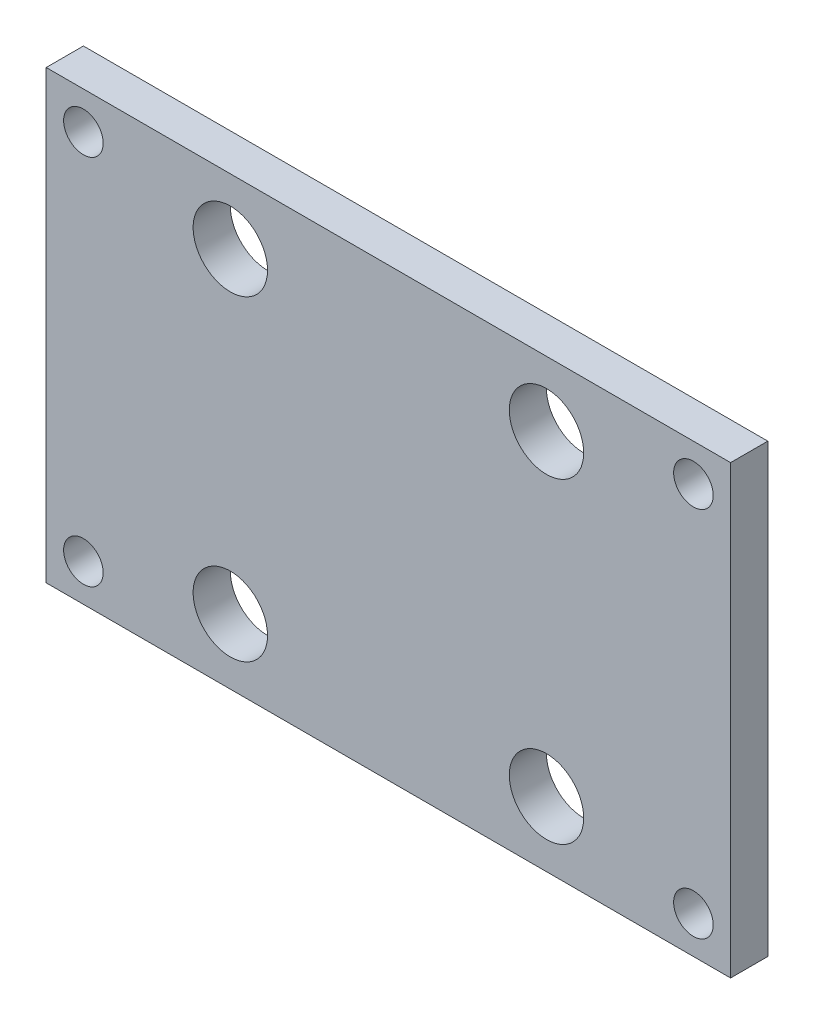
ISO-10303-21;
HEADER;
FILE_DESCRIPTION(('STEP AP214'),'2;1');
FILE_NAME('part.step','',(''),(''),'','','');
FILE_SCHEMA(('AUTOMOTIVE_DESIGN { 1 0 10303 214 1 1 1 1 }'));
ENDSEC;
DATA;
#1=APPLICATION_CONTEXT('core data for automotive mechanical design processes');
#2=APPLICATION_PROTOCOL_DEFINITION('international standard','automotive_design',2000,#1);
#3=PRODUCT_CONTEXT('',#1,'mechanical');
#4=PRODUCT('Part','Part','',(#3));
#5=PRODUCT_RELATED_PRODUCT_CATEGORY('part','',(#4));
#6=PRODUCT_DEFINITION_FORMATION('','',#4);
#7=PRODUCT_DEFINITION_CONTEXT('part definition',#1,'design');
#8=PRODUCT_DEFINITION('design','',#6,#7);
#9=PRODUCT_DEFINITION_SHAPE('','',#8);
#10=(LENGTH_UNIT() NAMED_UNIT(*) SI_UNIT(.MILLI.,.METRE.));
#11=(NAMED_UNIT(*) PLANE_ANGLE_UNIT() SI_UNIT($,.RADIAN.));
#12=(NAMED_UNIT(*) SI_UNIT($,.STERADIAN.) SOLID_ANGLE_UNIT());
#13=UNCERTAINTY_MEASURE_WITH_UNIT(LENGTH_MEASURE(1.E-05),#10,'distance_accuracy_value','');
#14=(GEOMETRIC_REPRESENTATION_CONTEXT(3) GLOBAL_UNCERTAINTY_ASSIGNED_CONTEXT((#13)) GLOBAL_UNIT_ASSIGNED_CONTEXT((#10,
#11,#12)) REPRESENTATION_CONTEXT('',''));
#15=CARTESIAN_POINT('',(0.,0.,0.));
#16=DIRECTION('',(0.,0.,1.));
#17=DIRECTION('',(1.,0.,0.));
#18=AXIS2_PLACEMENT_3D('',#15,#16,#17);
#19=CARTESIAN_POINT('',(58.42,-38.1,6.35));
#20=DIRECTION('',(-1.,0.,0.));
#21=DIRECTION('',(0.,0.,1.));
#22=AXIS2_PLACEMENT_3D('',#19,#20,#21);
#23=PLANE('',#22);
#24=DIRECTION('',(0.,1.,0.));
#25=VECTOR('',#24,1.);
#26=CARTESIAN_POINT('',(58.42,-38.1,0.));
#27=LINE('',#26,#25);
#28=CARTESIAN_POINT('',(58.42,-38.1,0.));
#29=VERTEX_POINT('',#28);
#30=CARTESIAN_POINT('',(58.42,38.1,0.));
#31=VERTEX_POINT('',#30);
#32=EDGE_CURVE('E100',#29,#31,#27,.T.);
#33=ORIENTED_EDGE('',*,*,#32,.T.);
#34=DIRECTION('',(0.,0.,-1.));
#35=VECTOR('',#34,1.);
#36=CARTESIAN_POINT('',(58.42,38.1,6.35));
#37=LINE('',#36,#35);
#38=CARTESIAN_POINT('',(58.42,38.1,6.35));
#39=VERTEX_POINT('',#38);
#40=EDGE_CURVE('E11',#39,#31,#37,.T.);
#41=ORIENTED_EDGE('',*,*,#40,.F.);
#42=DIRECTION('',(0.,1.,0.));
#43=VECTOR('',#42,1.);
#44=CARTESIAN_POINT('',(58.42,-38.1,6.35));
#45=LINE('',#44,#43);
#46=CARTESIAN_POINT('',(58.42,-38.1,6.35));
#47=VERTEX_POINT('',#46);
#48=EDGE_CURVE('E87',#47,#39,#45,.T.);
#49=ORIENTED_EDGE('',*,*,#48,.F.);
#50=DIRECTION('',(0.,0.,-1.));
#51=VECTOR('',#50,1.);
#52=CARTESIAN_POINT('',(58.42,-38.1,6.35));
#53=LINE('',#52,#51);
#54=EDGE_CURVE('E96',#47,#29,#53,.T.);
#55=ORIENTED_EDGE('',*,*,#54,.T.);
#56=EDGE_LOOP('',(#33,#41,#49,#55));
#57=FACE_BOUND('',#56,.T.);
#58=ADVANCED_FACE('F34',(#57),#23,.F.);
#59=CARTESIAN_POINT('',(-58.42,38.1,6.35));
#60=DIRECTION('',(0.,-1.,0.));
#61=DIRECTION('',(0.,0.,-1.));
#62=AXIS2_PLACEMENT_3D('',#59,#60,#61);
#63=PLANE('',#62);
#64=DIRECTION('',(-1.,0.,0.));
#65=VECTOR('',#64,1.);
#66=CARTESIAN_POINT('',(-58.42,38.1,0.));
#67=LINE('',#66,#65);
#68=CARTESIAN_POINT('',(-58.42,38.1,0.));
#69=VERTEX_POINT('',#68);
#70=EDGE_CURVE('E91',#31,#69,#67,.T.);
#71=ORIENTED_EDGE('',*,*,#70,.T.);
#72=DIRECTION('',(0.,0.,-1.));
#73=VECTOR('',#72,1.);
#74=CARTESIAN_POINT('',(-58.42,38.1,6.35));
#75=LINE('',#74,#73);
#76=CARTESIAN_POINT('',(-58.42,38.1,6.35));
#77=VERTEX_POINT('',#76);
#78=EDGE_CURVE('E43',#77,#69,#75,.T.);
#79=ORIENTED_EDGE('',*,*,#78,.F.);
#80=DIRECTION('',(-1.,0.,0.));
#81=VECTOR('',#80,1.);
#82=CARTESIAN_POINT('',(-58.42,38.1,6.35));
#83=LINE('',#82,#81);
#84=EDGE_CURVE('E82',#39,#77,#83,.T.);
#85=ORIENTED_EDGE('',*,*,#84,.F.);
#86=ORIENTED_EDGE('',*,*,#40,.T.);
#87=EDGE_LOOP('',(#71,#79,#85,#86));
#88=FACE_BOUND('',#87,.T.);
#89=ADVANCED_FACE('F90',(#88),#63,.F.);
#90=CARTESIAN_POINT('',(-58.42,-38.1,6.35));
#91=DIRECTION('',(1.,0.,0.));
#92=DIRECTION('',(0.,0.,-1.));
#93=AXIS2_PLACEMENT_3D('',#90,#91,#92);
#94=PLANE('',#93);
#95=DIRECTION('',(0.,-1.,0.));
#96=VECTOR('',#95,1.);
#97=CARTESIAN_POINT('',(-58.42,-38.1,0.));
#98=LINE('',#97,#96);
#99=CARTESIAN_POINT('',(-58.42,-38.1,0.));
#100=VERTEX_POINT('',#99);
#101=EDGE_CURVE('E69',#69,#100,#98,.T.);
#102=ORIENTED_EDGE('',*,*,#101,.T.);
#103=DIRECTION('',(0.,0.,-1.));
#104=VECTOR('',#103,1.);
#105=CARTESIAN_POINT('',(-58.42,-38.1,6.35));
#106=LINE('',#105,#104);
#107=CARTESIAN_POINT('',(-58.42,-38.1,6.35));
#108=VERTEX_POINT('',#107);
#109=EDGE_CURVE('E92',#108,#100,#106,.T.);
#110=ORIENTED_EDGE('',*,*,#109,.F.);
#111=DIRECTION('',(0.,-1.,0.));
#112=VECTOR('',#111,1.);
#113=CARTESIAN_POINT('',(-58.42,-38.1,6.35));
#114=LINE('',#113,#112);
#115=EDGE_CURVE('E85',#77,#108,#114,.T.);
#116=ORIENTED_EDGE('',*,*,#115,.F.);
#117=ORIENTED_EDGE('',*,*,#78,.T.);
#118=EDGE_LOOP('',(#102,#110,#116,#117));
#119=FACE_BOUND('',#118,.T.);
#120=ADVANCED_FACE('F94',(#119),#94,.F.);
#121=CARTESIAN_POINT('',(-58.42,-38.1,6.35));
#122=DIRECTION('',(0.,1.,0.));
#123=DIRECTION('',(0.,0.,1.));
#124=AXIS2_PLACEMENT_3D('',#121,#122,#123);
#125=PLANE('',#124);
#126=DIRECTION('',(1.,0.,0.));
#127=VECTOR('',#126,1.);
#128=CARTESIAN_POINT('',(-58.42,-38.1,0.));
#129=LINE('',#128,#127);
#130=EDGE_CURVE('E75',#100,#29,#129,.T.);
#131=ORIENTED_EDGE('',*,*,#130,.T.);
#132=ORIENTED_EDGE('',*,*,#54,.F.);
#133=DIRECTION('',(1.,0.,0.));
#134=VECTOR('',#133,1.);
#135=CARTESIAN_POINT('',(-58.42,-38.1,6.35));
#136=LINE('',#135,#134);
#137=EDGE_CURVE('E52',#108,#47,#136,.T.);
#138=ORIENTED_EDGE('',*,*,#137,.F.);
#139=ORIENTED_EDGE('',*,*,#109,.T.);
#140=EDGE_LOOP('',(#131,#132,#138,#139));
#141=FACE_BOUND('',#140,.T.);
#142=ADVANCED_FACE('F168',(#141),#125,.F.);
#143=CARTESIAN_POINT('',(58.42,38.1,6.35));
#144=DIRECTION('',(0.,0.,-1.));
#145=DIRECTION('',(-1.,0.,0.));
#146=AXIS2_PLACEMENT_3D('',#143,#144,#145);
#147=PLANE('',#146);
#148=CARTESIAN_POINT('',(-26.9875,26.9875,6.35));
#149=DIRECTION('',(0.,0.,1.));
#150=DIRECTION('',(1.,0.,0.));
#151=AXIS2_PLACEMENT_3D('',#148,#149,#150);
#152=CIRCLE('',#151,6.35);
#153=CARTESIAN_POINT('',(-20.6375,26.9875,6.35));
#154=VERTEX_POINT('',#153);
#155=EDGE_CURVE('E129',#154,#154,#152,.T.);
#156=ORIENTED_EDGE('',*,*,#155,.F.);
#157=EDGE_LOOP('',(#156));
#158=FACE_BOUND('',#157,.T.);
#159=CARTESIAN_POINT('',(26.9875,26.9875,6.35));
#160=DIRECTION('',(0.,0.,1.));
#161=DIRECTION('',(1.,0.,0.));
#162=AXIS2_PLACEMENT_3D('',#159,#160,#161);
#163=CIRCLE('',#162,6.35);
#164=CARTESIAN_POINT('',(33.3375,26.9875,6.35));
#165=VERTEX_POINT('',#164);
#166=EDGE_CURVE('E119',#165,#165,#163,.T.);
#167=ORIENTED_EDGE('',*,*,#166,.F.);
#168=EDGE_LOOP('',(#167));
#169=FACE_BOUND('',#168,.T.);
#170=CARTESIAN_POINT('',(26.9875,-26.9875,6.35));
#171=DIRECTION('',(0.,0.,1.));
#172=DIRECTION('',(1.,0.,0.));
#173=AXIS2_PLACEMENT_3D('',#170,#171,#172);
#174=CIRCLE('',#173,6.35);
#175=CARTESIAN_POINT('',(33.3375,-26.9875,6.35));
#176=VERTEX_POINT('',#175);
#177=EDGE_CURVE('E116',#176,#176,#174,.T.);
#178=ORIENTED_EDGE('',*,*,#177,.F.);
#179=EDGE_LOOP('',(#178));
#180=FACE_BOUND('',#179,.T.);
#181=CARTESIAN_POINT('',(-26.9875,-26.9875,6.35));
#182=DIRECTION('',(0.,0.,1.));
#183=DIRECTION('',(1.,0.,0.));
#184=AXIS2_PLACEMENT_3D('',#181,#182,#183);
#185=CIRCLE('',#184,6.35);
#186=CARTESIAN_POINT('',(-20.6375,-26.9875,6.35));
#187=VERTEX_POINT('',#186);
#188=EDGE_CURVE('E113',#187,#187,#185,.T.);
#189=ORIENTED_EDGE('',*,*,#188,.F.);
#190=EDGE_LOOP('',(#189));
#191=FACE_BOUND('',#190,.T.);
#192=CARTESIAN_POINT('',(52.07,31.75,6.35));
#193=DIRECTION('',(0.,0.,1.));
#194=DIRECTION('',(1.,0.,0.));
#195=AXIS2_PLACEMENT_3D('',#192,#193,#194);
#196=CIRCLE('',#195,3.37819999999998);
#197=CARTESIAN_POINT('',(55.4482,31.75,6.35));
#198=VERTEX_POINT('',#197);
#199=EDGE_CURVE('E112',#198,#198,#196,.T.);
#200=ORIENTED_EDGE('',*,*,#199,.F.);
#201=EDGE_LOOP('',(#200));
#202=FACE_BOUND('',#201,.T.);
#203=CARTESIAN_POINT('',(52.07,-31.75,6.35));
#204=DIRECTION('',(0.,0.,1.));
#205=DIRECTION('',(1.,0.,0.));
#206=AXIS2_PLACEMENT_3D('',#203,#204,#205);
#207=CIRCLE('',#206,3.37819999999998);
#208=CARTESIAN_POINT('',(55.4482,-31.75,6.35));
#209=VERTEX_POINT('',#208);
#210=EDGE_CURVE('E139',#209,#209,#207,.T.);
#211=ORIENTED_EDGE('',*,*,#210,.F.);
#212=EDGE_LOOP('',(#211));
#213=FACE_BOUND('',#212,.T.);
#214=CARTESIAN_POINT('',(-52.07,-31.75,6.35));
#215=DIRECTION('',(0.,0.,1.));
#216=DIRECTION('',(1.,0.,0.));
#217=AXIS2_PLACEMENT_3D('',#214,#215,#216);
#218=CIRCLE('',#217,3.37819999999998);
#219=CARTESIAN_POINT('',(-48.6918,-31.75,6.35));
#220=VERTEX_POINT('',#219);
#221=EDGE_CURVE('E145',#220,#220,#218,.T.);
#222=ORIENTED_EDGE('',*,*,#221,.F.);
#223=EDGE_LOOP('',(#222));
#224=FACE_BOUND('',#223,.T.);
#225=CARTESIAN_POINT('',(-52.07,31.75,6.35));
#226=DIRECTION('',(0.,0.,1.));
#227=DIRECTION('',(1.,0.,0.));
#228=AXIS2_PLACEMENT_3D('',#225,#226,#227);
#229=CIRCLE('',#228,3.37819999999998);
#230=CARTESIAN_POINT('',(-48.6918,31.75,6.35));
#231=VERTEX_POINT('',#230);
#232=EDGE_CURVE('E151',#231,#231,#229,.T.);
#233=ORIENTED_EDGE('',*,*,#232,.F.);
#234=EDGE_LOOP('',(#233));
#235=FACE_BOUND('',#234,.T.);
#236=ORIENTED_EDGE('',*,*,#48,.T.);
#237=ORIENTED_EDGE('',*,*,#84,.T.);
#238=ORIENTED_EDGE('',*,*,#115,.T.);
#239=ORIENTED_EDGE('',*,*,#137,.T.);
#240=EDGE_LOOP('',(#236,#237,#238,#239));
#241=FACE_BOUND('',#240,.T.);
#242=ADVANCED_FACE('F83',(#158,#169,#180,#191,#202,#213,#224,#235,#241),#147,.F.);
#243=CARTESIAN_POINT('',(58.42,38.1,0.));
#244=DIRECTION('',(0.,0.,-1.));
#245=DIRECTION('',(-1.,0.,0.));
#246=AXIS2_PLACEMENT_3D('',#243,#244,#245);
#247=PLANE('',#246);
#248=CARTESIAN_POINT('',(-26.9875,26.9875,0.));
#249=DIRECTION('',(0.,0.,-1.));
#250=DIRECTION('',(-1.,0.,0.));
#251=AXIS2_PLACEMENT_3D('',#248,#249,#250);
#252=CIRCLE('',#251,6.35);
#253=CARTESIAN_POINT('',(-33.3375,26.9875,0.));
#254=VERTEX_POINT('',#253);
#255=EDGE_CURVE('E37',#254,#254,#252,.T.);
#256=ORIENTED_EDGE('',*,*,#255,.F.);
#257=EDGE_LOOP('',(#256));
#258=FACE_BOUND('',#257,.T.);
#259=CARTESIAN_POINT('',(26.9875,26.9875,0.));
#260=DIRECTION('',(0.,0.,-1.));
#261=DIRECTION('',(-1.,0.,0.));
#262=AXIS2_PLACEMENT_3D('',#259,#260,#261);
#263=CIRCLE('',#262,6.35);
#264=CARTESIAN_POINT('',(20.6375,26.9875,0.));
#265=VERTEX_POINT('',#264);
#266=EDGE_CURVE('E117',#265,#265,#263,.T.);
#267=ORIENTED_EDGE('',*,*,#266,.F.);
#268=EDGE_LOOP('',(#267));
#269=FACE_BOUND('',#268,.T.);
#270=CARTESIAN_POINT('',(26.9875,-26.9875,0.));
#271=DIRECTION('',(0.,0.,-1.));
#272=DIRECTION('',(-1.,0.,0.));
#273=AXIS2_PLACEMENT_3D('',#270,#271,#272);
#274=CIRCLE('',#273,6.35);
#275=CARTESIAN_POINT('',(20.6375,-26.9875,0.));
#276=VERTEX_POINT('',#275);
#277=EDGE_CURVE('E114',#276,#276,#274,.T.);
#278=ORIENTED_EDGE('',*,*,#277,.F.);
#279=EDGE_LOOP('',(#278));
#280=FACE_BOUND('',#279,.T.);
#281=CARTESIAN_POINT('',(-26.9875,-26.9875,0.));
#282=DIRECTION('',(0.,0.,-1.));
#283=DIRECTION('',(-1.,0.,0.));
#284=AXIS2_PLACEMENT_3D('',#281,#282,#283);
#285=CIRCLE('',#284,6.35);
#286=CARTESIAN_POINT('',(-33.3375,-26.9875,0.));
#287=VERTEX_POINT('',#286);
#288=EDGE_CURVE('E109',#287,#287,#285,.T.);
#289=ORIENTED_EDGE('',*,*,#288,.F.);
#290=EDGE_LOOP('',(#289));
#291=FACE_BOUND('',#290,.T.);
#292=CARTESIAN_POINT('',(52.07,31.75,0.));
#293=DIRECTION('',(0.,0.,1.));
#294=DIRECTION('',(1.,0.,0.));
#295=AXIS2_PLACEMENT_3D('',#292,#293,#294);
#296=CIRCLE('',#295,3.3782);
#297=CARTESIAN_POINT('',(55.4482,31.75,0.));
#298=VERTEX_POINT('',#297);
#299=EDGE_CURVE('E136',#298,#298,#296,.T.);
#300=ORIENTED_EDGE('',*,*,#299,.T.);
#301=EDGE_LOOP('',(#300));
#302=FACE_BOUND('',#301,.T.);
#303=CARTESIAN_POINT('',(52.07,-31.75,0.));
#304=DIRECTION('',(0.,0.,1.));
#305=DIRECTION('',(1.,0.,0.));
#306=AXIS2_PLACEMENT_3D('',#303,#304,#305);
#307=CIRCLE('',#306,3.3782);
#308=CARTESIAN_POINT('',(55.4482,-31.75,0.));
#309=VERTEX_POINT('',#308);
#310=EDGE_CURVE('E142',#309,#309,#307,.T.);
#311=ORIENTED_EDGE('',*,*,#310,.T.);
#312=EDGE_LOOP('',(#311));
#313=FACE_BOUND('',#312,.T.);
#314=CARTESIAN_POINT('',(-52.07,-31.75,0.));
#315=DIRECTION('',(0.,0.,1.));
#316=DIRECTION('',(1.,0.,0.));
#317=AXIS2_PLACEMENT_3D('',#314,#315,#316);
#318=CIRCLE('',#317,3.3782);
#319=CARTESIAN_POINT('',(-48.6918,-31.75,0.));
#320=VERTEX_POINT('',#319);
#321=EDGE_CURVE('E148',#320,#320,#318,.T.);
#322=ORIENTED_EDGE('',*,*,#321,.T.);
#323=EDGE_LOOP('',(#322));
#324=FACE_BOUND('',#323,.T.);
#325=CARTESIAN_POINT('',(-52.07,31.75,0.));
#326=DIRECTION('',(0.,0.,1.));
#327=DIRECTION('',(1.,0.,0.));
#328=AXIS2_PLACEMENT_3D('',#325,#326,#327);
#329=CIRCLE('',#328,3.3782);
#330=CARTESIAN_POINT('',(-48.6918,31.75,0.));
#331=VERTEX_POINT('',#330);
#332=EDGE_CURVE('E103',#331,#331,#329,.T.);
#333=ORIENTED_EDGE('',*,*,#332,.T.);
#334=EDGE_LOOP('',(#333));
#335=FACE_BOUND('',#334,.T.);
#336=ORIENTED_EDGE('',*,*,#32,.F.);
#337=ORIENTED_EDGE('',*,*,#130,.F.);
#338=ORIENTED_EDGE('',*,*,#101,.F.);
#339=ORIENTED_EDGE('',*,*,#70,.F.);
#340=EDGE_LOOP('',(#336,#337,#338,#339));
#341=FACE_BOUND('',#340,.T.);
#342=ADVANCED_FACE('F157',(#258,#269,#280,#291,#302,#313,#324,#335,#341),#247,.T.);
#343=CARTESIAN_POINT('',(-52.07,31.75,6.35));
#344=DIRECTION('',(0.,0.,1.));
#345=DIRECTION('',(1.,0.,0.));
#346=AXIS2_PLACEMENT_3D('',#343,#344,#345);
#347=CYLINDRICAL_SURFACE('',#346,3.37819999999999);
#348=ORIENTED_EDGE('',*,*,#332,.F.);
#349=EDGE_LOOP('',(#348));
#350=FACE_BOUND('',#349,.T.);
#351=ORIENTED_EDGE('',*,*,#232,.T.);
#352=EDGE_LOOP('',(#351));
#353=FACE_BOUND('',#352,.T.);
#354=ADVANCED_FACE('F160',(#350,#353),#347,.F.);
#355=CARTESIAN_POINT('',(-52.07,-31.75,6.35));
#356=DIRECTION('',(0.,0.,1.));
#357=DIRECTION('',(1.,0.,0.));
#358=AXIS2_PLACEMENT_3D('',#355,#356,#357);
#359=CYLINDRICAL_SURFACE('',#358,3.37819999999999);
#360=ORIENTED_EDGE('',*,*,#321,.F.);
#361=EDGE_LOOP('',(#360));
#362=FACE_BOUND('',#361,.T.);
#363=ORIENTED_EDGE('',*,*,#221,.T.);
#364=EDGE_LOOP('',(#363));
#365=FACE_BOUND('',#364,.T.);
#366=ADVANCED_FACE('F163',(#362,#365),#359,.F.);
#367=CARTESIAN_POINT('',(52.07,-31.75,6.35));
#368=DIRECTION('',(0.,0.,1.));
#369=DIRECTION('',(1.,0.,0.));
#370=AXIS2_PLACEMENT_3D('',#367,#368,#369);
#371=CYLINDRICAL_SURFACE('',#370,3.37819999999999);
#372=ORIENTED_EDGE('',*,*,#310,.F.);
#373=EDGE_LOOP('',(#372));
#374=FACE_BOUND('',#373,.T.);
#375=ORIENTED_EDGE('',*,*,#210,.T.);
#376=EDGE_LOOP('',(#375));
#377=FACE_BOUND('',#376,.T.);
#378=ADVANCED_FACE('F213',(#374,#377),#371,.F.);
#379=CARTESIAN_POINT('',(52.07,31.75,6.35));
#380=DIRECTION('',(0.,0.,1.));
#381=DIRECTION('',(1.,0.,0.));
#382=AXIS2_PLACEMENT_3D('',#379,#380,#381);
#383=CYLINDRICAL_SURFACE('',#382,3.37819999999999);
#384=ORIENTED_EDGE('',*,*,#299,.F.);
#385=EDGE_LOOP('',(#384));
#386=FACE_BOUND('',#385,.T.);
#387=ORIENTED_EDGE('',*,*,#199,.T.);
#388=EDGE_LOOP('',(#387));
#389=FACE_BOUND('',#388,.T.);
#390=ADVANCED_FACE('F223',(#386,#389),#383,.F.);
#391=CARTESIAN_POINT('',(-26.9875,-26.9875,6.35));
#392=DIRECTION('',(0.,0.,1.));
#393=DIRECTION('',(1.,0.,0.));
#394=AXIS2_PLACEMENT_3D('',#391,#392,#393);
#395=CYLINDRICAL_SURFACE('',#394,6.35);
#396=ORIENTED_EDGE('',*,*,#288,.T.);
#397=EDGE_LOOP('',(#396));
#398=FACE_BOUND('',#397,.T.);
#399=ORIENTED_EDGE('',*,*,#188,.T.);
#400=EDGE_LOOP('',(#399));
#401=FACE_BOUND('',#400,.T.);
#402=ADVANCED_FACE('F232',(#398,#401),#395,.F.);
#403=CARTESIAN_POINT('',(26.9875,-26.9875,6.35));
#404=DIRECTION('',(0.,0.,1.));
#405=DIRECTION('',(1.,0.,0.));
#406=AXIS2_PLACEMENT_3D('',#403,#404,#405);
#407=CYLINDRICAL_SURFACE('',#406,6.35);
#408=ORIENTED_EDGE('',*,*,#277,.T.);
#409=EDGE_LOOP('',(#408));
#410=FACE_BOUND('',#409,.T.);
#411=ORIENTED_EDGE('',*,*,#177,.T.);
#412=EDGE_LOOP('',(#411));
#413=FACE_BOUND('',#412,.T.);
#414=ADVANCED_FACE('F251',(#410,#413),#407,.F.);
#415=CARTESIAN_POINT('',(26.9875,26.9875,6.35));
#416=DIRECTION('',(0.,0.,1.));
#417=DIRECTION('',(1.,0.,0.));
#418=AXIS2_PLACEMENT_3D('',#415,#416,#417);
#419=CYLINDRICAL_SURFACE('',#418,6.35);
#420=ORIENTED_EDGE('',*,*,#266,.T.);
#421=EDGE_LOOP('',(#420));
#422=FACE_BOUND('',#421,.T.);
#423=ORIENTED_EDGE('',*,*,#166,.T.);
#424=EDGE_LOOP('',(#423));
#425=FACE_BOUND('',#424,.T.);
#426=ADVANCED_FACE('F261',(#422,#425),#419,.F.);
#427=CARTESIAN_POINT('',(-26.9875,26.9875,6.35));
#428=DIRECTION('',(0.,0.,1.));
#429=DIRECTION('',(1.,0.,0.));
#430=AXIS2_PLACEMENT_3D('',#427,#428,#429);
#431=CYLINDRICAL_SURFACE('',#430,6.35);
#432=ORIENTED_EDGE('',*,*,#255,.T.);
#433=EDGE_LOOP('',(#432));
#434=FACE_BOUND('',#433,.T.);
#435=ORIENTED_EDGE('',*,*,#155,.T.);
#436=EDGE_LOOP('',(#435));
#437=FACE_BOUND('',#436,.T.);
#438=ADVANCED_FACE('F271',(#434,#437),#431,.F.);
#439=CLOSED_SHELL('',(#58,#89,#120,#142,#242,#342,#354,#366,#378,#390,#402,#414,#426,#438));
#440=MANIFOLD_SOLID_BREP('B2',#439);
#441=ADVANCED_BREP_SHAPE_REPRESENTATION('',(#18,#440),#14);
#442=SHAPE_DEFINITION_REPRESENTATION(#9,#441);
ENDSEC;
END-ISO-10303-21;
